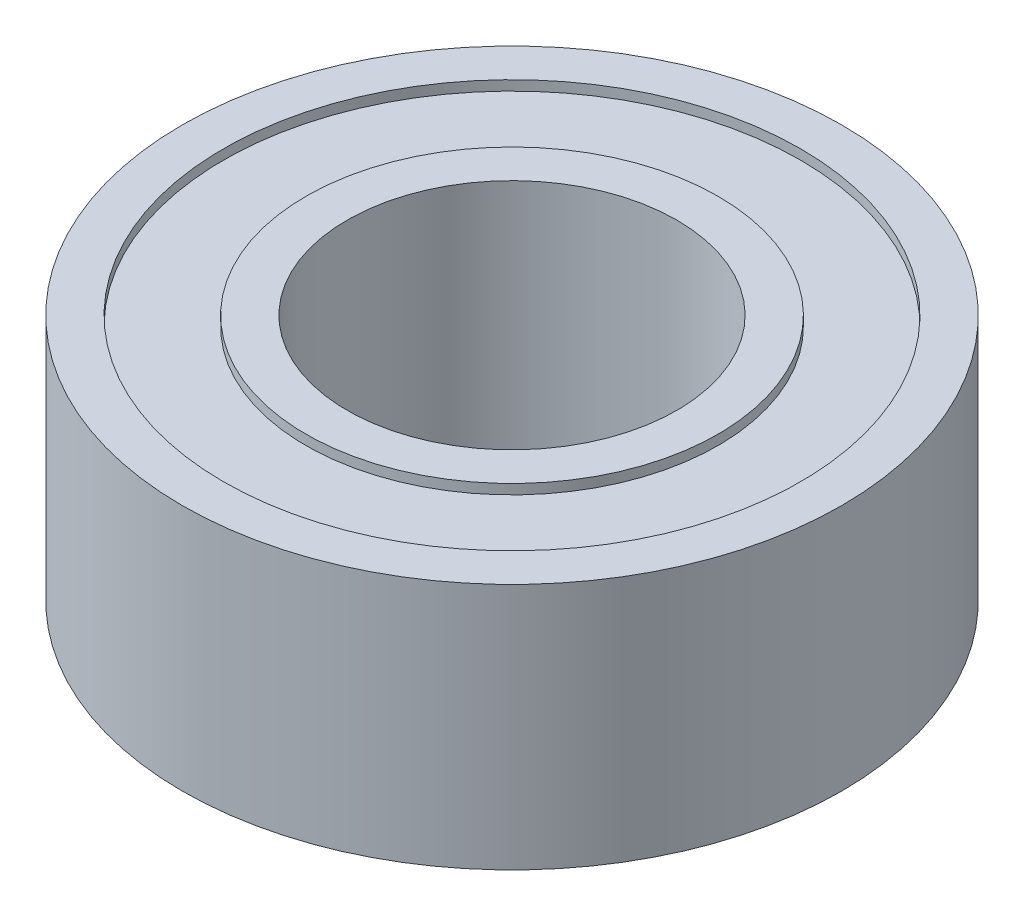
ISO-10303-21;
HEADER;
FILE_DESCRIPTION(('STEP AP214'),'2;1');
FILE_NAME('part.step','',(''),(''),'','','');
FILE_SCHEMA(('AUTOMOTIVE_DESIGN { 1 0 10303 214 1 1 1 1 }'));
ENDSEC;
DATA;
#1=APPLICATION_CONTEXT('core data for automotive mechanical design processes');
#2=APPLICATION_PROTOCOL_DEFINITION('international standard','automotive_design',2000,#1);
#3=PRODUCT_CONTEXT('',#1,'mechanical');
#4=PRODUCT('Part','Part','',(#3));
#5=PRODUCT_RELATED_PRODUCT_CATEGORY('part','',(#4));
#6=PRODUCT_DEFINITION_FORMATION('','',#4);
#7=PRODUCT_DEFINITION_CONTEXT('part definition',#1,'design');
#8=PRODUCT_DEFINITION('design','',#6,#7);
#9=PRODUCT_DEFINITION_SHAPE('','',#8);
#10=(LENGTH_UNIT() NAMED_UNIT(*) SI_UNIT(.MILLI.,.METRE.));
#11=(NAMED_UNIT(*) PLANE_ANGLE_UNIT() SI_UNIT($,.RADIAN.));
#12=(NAMED_UNIT(*) SI_UNIT($,.STERADIAN.) SOLID_ANGLE_UNIT());
#13=UNCERTAINTY_MEASURE_WITH_UNIT(LENGTH_MEASURE(1.E-05),#10,'distance_accuracy_value','');
#14=(GEOMETRIC_REPRESENTATION_CONTEXT(3) GLOBAL_UNCERTAINTY_ASSIGNED_CONTEXT((#13)) GLOBAL_UNIT_ASSIGNED_CONTEXT((#10,
#11,#12)) REPRESENTATION_CONTEXT('',''));
#15=CARTESIAN_POINT('',(0.,0.,0.));
#16=DIRECTION('',(0.,0.,1.));
#17=DIRECTION('',(1.,0.,0.));
#18=AXIS2_PLACEMENT_3D('',#15,#16,#17);
#19=CARTESIAN_POINT('',(0.,9.525,0.));
#20=DIRECTION('',(0.,-1.,0.));
#21=DIRECTION('',(0.,0.,-1.));
#22=AXIS2_PLACEMENT_3D('',#19,#20,#21);
#23=PLANE('',#22);
#24=CARTESIAN_POINT('',(0.,9.525,0.));
#25=DIRECTION('',(0.,-1.,0.));
#26=DIRECTION('',(0.,0.,-1.));
#27=AXIS2_PLACEMENT_3D('',#24,#25,#26);
#28=CIRCLE('',#27,15.875);
#29=CARTESIAN_POINT('',(0.,9.525,-15.875));
#30=VERTEX_POINT('',#29);
#31=EDGE_CURVE('E53',#30,#30,#28,.T.);
#32=ORIENTED_EDGE('',*,*,#31,.F.);
#33=EDGE_LOOP('',(#32));
#34=FACE_BOUND('',#33,.T.);
#35=CARTESIAN_POINT('',(0.,9.525,0.));
#36=DIRECTION('',(0.,-1.,0.));
#37=DIRECTION('',(0.,0.,-1.));
#38=AXIS2_PLACEMENT_3D('',#35,#36,#37);
#39=CIRCLE('',#38,12.7);
#40=CARTESIAN_POINT('',(0.,9.525,-12.7));
#41=VERTEX_POINT('',#40);
#42=EDGE_CURVE('E10',#41,#41,#39,.T.);
#43=ORIENTED_EDGE('',*,*,#42,.T.);
#44=EDGE_LOOP('',(#43));
#45=FACE_BOUND('',#44,.T.);
#46=ADVANCED_FACE('F31',(#34,#45),#23,.F.);
#47=CARTESIAN_POINT('',(0.,0.,0.));
#48=DIRECTION('',(0.,-1.,0.));
#49=DIRECTION('',(0.,0.,-1.));
#50=AXIS2_PLACEMENT_3D('',#47,#48,#49);
#51=CYLINDRICAL_SURFACE('',#50,12.7);
#52=ORIENTED_EDGE('',*,*,#42,.F.);
#53=EDGE_LOOP('',(#52));
#54=FACE_BOUND('',#53,.T.);
#55=CARTESIAN_POINT('',(0.,-9.525,0.));
#56=DIRECTION('',(0.,-1.,0.));
#57=DIRECTION('',(0.,0.,-1.));
#58=AXIS2_PLACEMENT_3D('',#55,#56,#57);
#59=CIRCLE('',#58,12.7);
#60=CARTESIAN_POINT('',(0.,-9.525,-12.7));
#61=VERTEX_POINT('',#60);
#62=EDGE_CURVE('E56',#61,#61,#59,.T.);
#63=ORIENTED_EDGE('',*,*,#62,.T.);
#64=EDGE_LOOP('',(#63));
#65=FACE_BOUND('',#64,.T.);
#66=ADVANCED_FACE('F90',(#54,#65),#51,.F.);
#67=CARTESIAN_POINT('',(0.,0.,0.));
#68=DIRECTION('',(0.,-1.,0.));
#69=DIRECTION('',(0.,0.,-1.));
#70=AXIS2_PLACEMENT_3D('',#67,#68,#69);
#71=CYLINDRICAL_SURFACE('',#70,25.4);
#72=CARTESIAN_POINT('',(0.,9.525,0.));
#73=DIRECTION('',(0.,-1.,0.));
#74=DIRECTION('',(0.,0.,-1.));
#75=AXIS2_PLACEMENT_3D('',#72,#73,#74);
#76=CIRCLE('',#75,25.4);
#77=CARTESIAN_POINT('',(0.,9.525,-25.4));
#78=VERTEX_POINT('',#77);
#79=EDGE_CURVE('E37',#78,#78,#76,.T.);
#80=ORIENTED_EDGE('',*,*,#79,.T.);
#81=EDGE_LOOP('',(#80));
#82=FACE_BOUND('',#81,.T.);
#83=CARTESIAN_POINT('',(0.,-9.525,0.));
#84=DIRECTION('',(0.,-1.,0.));
#85=DIRECTION('',(0.,0.,-1.));
#86=AXIS2_PLACEMENT_3D('',#83,#84,#85);
#87=CIRCLE('',#86,25.4);
#88=CARTESIAN_POINT('',(0.,-9.525,-25.4));
#89=VERTEX_POINT('',#88);
#90=EDGE_CURVE('E59',#89,#89,#87,.T.);
#91=ORIENTED_EDGE('',*,*,#90,.F.);
#92=EDGE_LOOP('',(#91));
#93=FACE_BOUND('',#92,.T.);
#94=ADVANCED_FACE('F95',(#82,#93),#71,.T.);
#95=CARTESIAN_POINT('',(0.,9.525,0.));
#96=DIRECTION('',(0.,-1.,0.));
#97=DIRECTION('',(0.,0.,-1.));
#98=AXIS2_PLACEMENT_3D('',#95,#96,#97);
#99=PLANE('',#98);
#100=ORIENTED_EDGE('',*,*,#79,.F.);
#101=EDGE_LOOP('',(#100));
#102=FACE_BOUND('',#101,.T.);
#103=CARTESIAN_POINT('',(0.,9.525,0.));
#104=DIRECTION('',(0.,-1.,0.));
#105=DIRECTION('',(0.,0.,-1.));
#106=AXIS2_PLACEMENT_3D('',#103,#104,#105);
#107=CIRCLE('',#106,22.225);
#108=CARTESIAN_POINT('',(0.,9.525,-22.225));
#109=VERTEX_POINT('',#108);
#110=EDGE_CURVE('E41',#109,#109,#107,.T.);
#111=ORIENTED_EDGE('',*,*,#110,.T.);
#112=EDGE_LOOP('',(#111));
#113=FACE_BOUND('',#112,.T.);
#114=ADVANCED_FACE('F118',(#102,#113),#99,.F.);
#115=CARTESIAN_POINT('',(0.,0.,0.));
#116=DIRECTION('',(0.,-1.,0.));
#117=DIRECTION('',(0.,0.,-1.));
#118=AXIS2_PLACEMENT_3D('',#115,#116,#117);
#119=CYLINDRICAL_SURFACE('',#118,22.225);
#120=ORIENTED_EDGE('',*,*,#110,.F.);
#121=EDGE_LOOP('',(#120));
#122=FACE_BOUND('',#121,.T.);
#123=CARTESIAN_POINT('',(0.,8.763,0.));
#124=DIRECTION('',(0.,-1.,0.));
#125=DIRECTION('',(0.,0.,-1.));
#126=AXIS2_PLACEMENT_3D('',#123,#124,#125);
#127=CIRCLE('',#126,22.225);
#128=CARTESIAN_POINT('',(0.,8.763,-22.225));
#129=VERTEX_POINT('',#128);
#130=EDGE_CURVE('E45',#129,#129,#127,.T.);
#131=ORIENTED_EDGE('',*,*,#130,.T.);
#132=EDGE_LOOP('',(#131));
#133=FACE_BOUND('',#132,.T.);
#134=ADVANCED_FACE('F110',(#122,#133),#119,.F.);
#135=CARTESIAN_POINT('',(0.,8.763,0.));
#136=DIRECTION('',(0.,-1.,0.));
#137=DIRECTION('',(0.,0.,-1.));
#138=AXIS2_PLACEMENT_3D('',#135,#136,#137);
#139=PLANE('',#138);
#140=ORIENTED_EDGE('',*,*,#130,.F.);
#141=EDGE_LOOP('',(#140));
#142=FACE_BOUND('',#141,.T.);
#143=CARTESIAN_POINT('',(0.,8.763,0.));
#144=DIRECTION('',(0.,-1.,0.));
#145=DIRECTION('',(0.,0.,-1.));
#146=AXIS2_PLACEMENT_3D('',#143,#144,#145);
#147=CIRCLE('',#146,15.875);
#148=CARTESIAN_POINT('',(0.,8.763,-15.875));
#149=VERTEX_POINT('',#148);
#150=EDGE_CURVE('E50',#149,#149,#147,.T.);
#151=ORIENTED_EDGE('',*,*,#150,.T.);
#152=EDGE_LOOP('',(#151));
#153=FACE_BOUND('',#152,.T.);
#154=ADVANCED_FACE('F101',(#142,#153),#139,.F.);
#155=CARTESIAN_POINT('',(0.,0.,0.));
#156=DIRECTION('',(0.,-1.,0.));
#157=DIRECTION('',(0.,0.,-1.));
#158=AXIS2_PLACEMENT_3D('',#155,#156,#157);
#159=CYLINDRICAL_SURFACE('',#158,15.875);
#160=ORIENTED_EDGE('',*,*,#150,.F.);
#161=EDGE_LOOP('',(#160));
#162=FACE_BOUND('',#161,.T.);
#163=ORIENTED_EDGE('',*,*,#31,.T.);
#164=EDGE_LOOP('',(#163));
#165=FACE_BOUND('',#164,.T.);
#166=ADVANCED_FACE('F99',(#162,#165),#159,.T.);
#167=CARTESIAN_POINT('',(0.,-9.525,0.));
#168=DIRECTION('',(0.,1.,0.));
#169=DIRECTION('',(0.,0.,-1.));
#170=AXIS2_PLACEMENT_3D('',#167,#168,#169);
#171=PLANE('',#170);
#172=CARTESIAN_POINT('',(0.,-9.525,0.));
#173=DIRECTION('',(0.,-1.,0.));
#174=DIRECTION('',(0.,0.,-1.));
#175=AXIS2_PLACEMENT_3D('',#172,#173,#174);
#176=CIRCLE('',#175,15.875);
#177=CARTESIAN_POINT('',(0.,-9.525,-15.875));
#178=VERTEX_POINT('',#177);
#179=EDGE_CURVE('E71',#178,#178,#176,.T.);
#180=ORIENTED_EDGE('',*,*,#179,.T.);
#181=EDGE_LOOP('',(#180));
#182=FACE_BOUND('',#181,.T.);
#183=ORIENTED_EDGE('',*,*,#62,.F.);
#184=EDGE_LOOP('',(#183));
#185=FACE_BOUND('',#184,.T.);
#186=ADVANCED_FACE('F75',(#182,#185),#171,.F.);
#187=CARTESIAN_POINT('',(0.,-9.525,0.));
#188=DIRECTION('',(0.,1.,0.));
#189=DIRECTION('',(0.,0.,-1.));
#190=AXIS2_PLACEMENT_3D('',#187,#188,#189);
#191=PLANE('',#190);
#192=ORIENTED_EDGE('',*,*,#90,.T.);
#193=EDGE_LOOP('',(#192));
#194=FACE_BOUND('',#193,.T.);
#195=CARTESIAN_POINT('',(0.,-9.525,0.));
#196=DIRECTION('',(0.,-1.,0.));
#197=DIRECTION('',(0.,0.,-1.));
#198=AXIS2_PLACEMENT_3D('',#195,#196,#197);
#199=CIRCLE('',#198,22.225);
#200=CARTESIAN_POINT('',(0.,-9.525,-22.225));
#201=VERTEX_POINT('',#200);
#202=EDGE_CURVE('E62',#201,#201,#199,.T.);
#203=ORIENTED_EDGE('',*,*,#202,.F.);
#204=EDGE_LOOP('',(#203));
#205=FACE_BOUND('',#204,.T.);
#206=ADVANCED_FACE('F108',(#194,#205),#191,.F.);
#207=CARTESIAN_POINT('',(0.,0.,0.));
#208=DIRECTION('',(0.,1.,0.));
#209=DIRECTION('',(0.,0.,-1.));
#210=AXIS2_PLACEMENT_3D('',#207,#208,#209);
#211=CYLINDRICAL_SURFACE('',#210,22.225);
#212=ORIENTED_EDGE('',*,*,#202,.T.);
#213=EDGE_LOOP('',(#212));
#214=FACE_BOUND('',#213,.T.);
#215=CARTESIAN_POINT('',(0.,-8.763,0.));
#216=DIRECTION('',(0.,-1.,0.));
#217=DIRECTION('',(0.,0.,-1.));
#218=AXIS2_PLACEMENT_3D('',#215,#216,#217);
#219=CIRCLE('',#218,22.225);
#220=CARTESIAN_POINT('',(0.,-8.763,-22.225));
#221=VERTEX_POINT('',#220);
#222=EDGE_CURVE('E65',#221,#221,#219,.T.);
#223=ORIENTED_EDGE('',*,*,#222,.F.);
#224=EDGE_LOOP('',(#223));
#225=FACE_BOUND('',#224,.T.);
#226=ADVANCED_FACE('F86',(#214,#225),#211,.F.);
#227=CARTESIAN_POINT('',(0.,-8.763,0.));
#228=DIRECTION('',(0.,1.,0.));
#229=DIRECTION('',(0.,0.,-1.));
#230=AXIS2_PLACEMENT_3D('',#227,#228,#229);
#231=PLANE('',#230);
#232=ORIENTED_EDGE('',*,*,#222,.T.);
#233=EDGE_LOOP('',(#232));
#234=FACE_BOUND('',#233,.T.);
#235=CARTESIAN_POINT('',(0.,-8.763,0.));
#236=DIRECTION('',(0.,-1.,0.));
#237=DIRECTION('',(0.,0.,-1.));
#238=AXIS2_PLACEMENT_3D('',#235,#236,#237);
#239=CIRCLE('',#238,15.875);
#240=CARTESIAN_POINT('',(0.,-8.763,-15.875));
#241=VERTEX_POINT('',#240);
#242=EDGE_CURVE('E68',#241,#241,#239,.T.);
#243=ORIENTED_EDGE('',*,*,#242,.F.);
#244=EDGE_LOOP('',(#243));
#245=FACE_BOUND('',#244,.T.);
#246=ADVANCED_FACE('F80',(#234,#245),#231,.F.);
#247=CARTESIAN_POINT('',(0.,0.,0.));
#248=DIRECTION('',(0.,1.,0.));
#249=DIRECTION('',(0.,0.,-1.));
#250=AXIS2_PLACEMENT_3D('',#247,#248,#249);
#251=CYLINDRICAL_SURFACE('',#250,15.875);
#252=ORIENTED_EDGE('',*,*,#242,.T.);
#253=EDGE_LOOP('',(#252));
#254=FACE_BOUND('',#253,.T.);
#255=ORIENTED_EDGE('',*,*,#179,.F.);
#256=EDGE_LOOP('',(#255));
#257=FACE_BOUND('',#256,.T.);
#258=ADVANCED_FACE('F78',(#254,#257),#251,.T.);
#259=CLOSED_SHELL('',(#46,#66,#94,#114,#134,#154,#166,#186,#206,#226,#246,#258));
#260=MANIFOLD_SOLID_BREP('B2',#259);
#261=ADVANCED_BREP_SHAPE_REPRESENTATION('',(#18,#260),#14);
#262=SHAPE_DEFINITION_REPRESENTATION(#9,#261);
ENDSEC;
END-ISO-10303-21;
